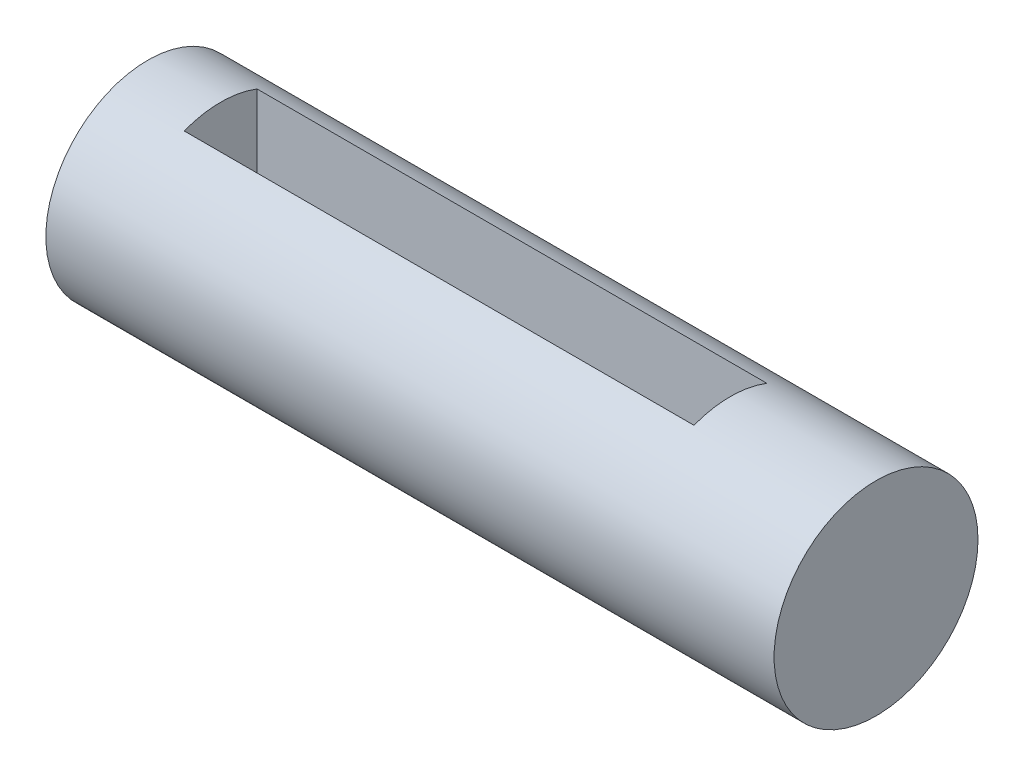
ISO-10303-21;
HEADER;
FILE_DESCRIPTION(('STEP AP214'),'2;1');
FILE_NAME('part.step','',(''),(''),'','','');
FILE_SCHEMA(('AUTOMOTIVE_DESIGN { 1 0 10303 214 1 1 1 1 }'));
ENDSEC;
DATA;
#1=APPLICATION_CONTEXT('core data for automotive mechanical design processes');
#2=APPLICATION_PROTOCOL_DEFINITION('international standard','automotive_design',2000,#1);
#3=PRODUCT_CONTEXT('',#1,'mechanical');
#4=PRODUCT('Part','Part','',(#3));
#5=PRODUCT_RELATED_PRODUCT_CATEGORY('part','',(#4));
#6=PRODUCT_DEFINITION_FORMATION('','',#4);
#7=PRODUCT_DEFINITION_CONTEXT('part definition',#1,'design');
#8=PRODUCT_DEFINITION('design','',#6,#7);
#9=PRODUCT_DEFINITION_SHAPE('','',#8);
#10=(LENGTH_UNIT() NAMED_UNIT(*) SI_UNIT(.MILLI.,.METRE.));
#11=(NAMED_UNIT(*) PLANE_ANGLE_UNIT() SI_UNIT($,.RADIAN.));
#12=(NAMED_UNIT(*) SI_UNIT($,.STERADIAN.) SOLID_ANGLE_UNIT());
#13=UNCERTAINTY_MEASURE_WITH_UNIT(LENGTH_MEASURE(1.E-05),#10,'distance_accuracy_value','');
#14=(GEOMETRIC_REPRESENTATION_CONTEXT(3) GLOBAL_UNCERTAINTY_ASSIGNED_CONTEXT((#13)) GLOBAL_UNIT_ASSIGNED_CONTEXT((#10,
#11,#12)) REPRESENTATION_CONTEXT('',''));
#15=CARTESIAN_POINT('',(0.,0.,0.));
#16=DIRECTION('',(0.,0.,1.));
#17=DIRECTION('',(1.,0.,0.));
#18=AXIS2_PLACEMENT_3D('',#15,#16,#17);
#19=CARTESIAN_POINT('',(50.,0.,0.));
#20=DIRECTION('',(-1.,0.,0.));
#21=DIRECTION('',(0.,0.,1.));
#22=AXIS2_PLACEMENT_3D('',#19,#20,#21);
#23=CYLINDRICAL_SURFACE('',#22,7.);
#24=DIRECTION('',(-1.,0.,0.));
#25=VECTOR('',#24,1.);
#26=CARTESIAN_POINT('',(50.,-6.53834841531101,-2.5));
#27=LINE('',#26,#25);
#28=CARTESIAN_POINT('',(5.,-6.53834841531101,-2.5));
#29=VERTEX_POINT('',#28);
#30=CARTESIAN_POINT('',(40.,-6.53834841531101,-2.5));
#31=VERTEX_POINT('',#30);
#32=EDGE_CURVE('E93',#29,#31,#27,.F.);
#33=ORIENTED_EDGE('',*,*,#32,.F.);
#34=CARTESIAN_POINT('',(5.,0.,0.));
#35=DIRECTION('',(-1.,0.,0.));
#36=DIRECTION('',(0.,-1.,0.));
#37=AXIS2_PLACEMENT_3D('',#34,#35,#36);
#38=CIRCLE('',#37,7.);
#39=CARTESIAN_POINT('',(5.,-6.53834841531101,2.5));
#40=VERTEX_POINT('',#39);
#41=EDGE_CURVE('E86',#29,#40,#38,.T.);
#42=ORIENTED_EDGE('',*,*,#41,.T.);
#43=DIRECTION('',(-1.,0.,0.));
#44=VECTOR('',#43,1.);
#45=CARTESIAN_POINT('',(50.,-6.53834841531101,2.5));
#46=LINE('',#45,#44);
#47=CARTESIAN_POINT('',(40.,-6.53834841531101,2.5));
#48=VERTEX_POINT('',#47);
#49=EDGE_CURVE('E76',#40,#48,#46,.F.);
#50=ORIENTED_EDGE('',*,*,#49,.T.);
#51=CARTESIAN_POINT('',(40.,0.,0.));
#52=DIRECTION('',(1.,0.,0.));
#53=DIRECTION('',(0.,0.,-1.));
#54=AXIS2_PLACEMENT_3D('',#51,#52,#53);
#55=CIRCLE('',#54,7.);
#56=EDGE_CURVE('E80',#48,#31,#55,.T.);
#57=ORIENTED_EDGE('',*,*,#56,.T.);
#58=EDGE_LOOP('',(#33,#42,#50,#57));
#59=FACE_BOUND('',#58,.T.);
#60=CARTESIAN_POINT('',(50.,0.,0.));
#61=DIRECTION('',(1.,0.,0.));
#62=DIRECTION('',(0.,0.,-1.));
#63=AXIS2_PLACEMENT_3D('',#60,#61,#62);
#64=CIRCLE('',#63,7.);
#65=CARTESIAN_POINT('',(50.,0.,-7.));
#66=VERTEX_POINT('',#65);
#67=EDGE_CURVE('E81',#66,#66,#64,.T.);
#68=ORIENTED_EDGE('',*,*,#67,.F.);
#69=EDGE_LOOP('',(#68));
#70=FACE_BOUND('',#69,.T.);
#71=CARTESIAN_POINT('',(0.,0.,0.));
#72=DIRECTION('',(1.,0.,0.));
#73=DIRECTION('',(0.,0.,-1.));
#74=AXIS2_PLACEMENT_3D('',#71,#72,#73);
#75=CIRCLE('',#74,7.);
#76=CARTESIAN_POINT('',(0.,0.,-7.));
#77=VERTEX_POINT('',#76);
#78=EDGE_CURVE('E103',#77,#77,#75,.T.);
#79=ORIENTED_EDGE('',*,*,#78,.T.);
#80=EDGE_LOOP('',(#79));
#81=FACE_BOUND('',#80,.T.);
#82=CARTESIAN_POINT('',(5.,6.53834841531101,2.5));
#83=VERTEX_POINT('',#82);
#84=CARTESIAN_POINT('',(5.,6.53834841531101,-2.5));
#85=VERTEX_POINT('',#84);
#86=EDGE_CURVE('E46',#83,#85,#38,.T.);
#87=ORIENTED_EDGE('',*,*,#86,.T.);
#88=DIRECTION('',(-1.,0.,0.));
#89=VECTOR('',#88,1.);
#90=CARTESIAN_POINT('',(50.,6.53834841531101,-2.5));
#91=LINE('',#90,#89);
#92=CARTESIAN_POINT('',(40.,6.53834841531101,-2.5));
#93=VERTEX_POINT('',#92);
#94=EDGE_CURVE('E11',#93,#85,#91,.T.);
#95=ORIENTED_EDGE('',*,*,#94,.F.);
#96=CARTESIAN_POINT('',(40.,6.53834841531101,2.5));
#97=VERTEX_POINT('',#96);
#98=EDGE_CURVE('E98',#93,#97,#55,.T.);
#99=ORIENTED_EDGE('',*,*,#98,.T.);
#100=DIRECTION('',(-1.,0.,0.));
#101=VECTOR('',#100,1.);
#102=CARTESIAN_POINT('',(50.,6.53834841531101,2.5));
#103=LINE('',#102,#101);
#104=EDGE_CURVE('E95',#97,#83,#103,.T.);
#105=ORIENTED_EDGE('',*,*,#104,.T.);
#106=EDGE_LOOP('',(#87,#95,#99,#105));
#107=FACE_BOUND('',#106,.T.);
#108=ADVANCED_FACE('F39',(#59,#70,#81,#107),#23,.T.);
#109=CARTESIAN_POINT('',(50.,0.,0.));
#110=DIRECTION('',(1.,0.,0.));
#111=DIRECTION('',(0.,0.,-1.));
#112=AXIS2_PLACEMENT_3D('',#109,#110,#111);
#113=PLANE('',#112);
#114=ORIENTED_EDGE('',*,*,#67,.T.);
#115=EDGE_LOOP('',(#114));
#116=FACE_BOUND('',#115,.T.);
#117=ADVANCED_FACE('F117',(#116),#113,.T.);
#118=CARTESIAN_POINT('',(0.,0.,0.));
#119=DIRECTION('',(1.,0.,0.));
#120=DIRECTION('',(0.,0.,-1.));
#121=AXIS2_PLACEMENT_3D('',#118,#119,#120);
#122=PLANE('',#121);
#123=ORIENTED_EDGE('',*,*,#78,.F.);
#124=EDGE_LOOP('',(#123));
#125=FACE_BOUND('',#124,.T.);
#126=ADVANCED_FACE('F123',(#125),#122,.F.);
#127=CARTESIAN_POINT('',(5.,7.,-2.5));
#128=DIRECTION('',(-1.,0.,0.));
#129=DIRECTION('',(0.,-1.,0.));
#130=AXIS2_PLACEMENT_3D('',#127,#128,#129);
#131=PLANE('',#130);
#132=DIRECTION('',(0.,-1.,0.));
#133=VECTOR('',#132,1.);
#134=CARTESIAN_POINT('',(5.,7.,2.5));
#135=LINE('',#134,#133);
#136=EDGE_CURVE('E53',#83,#40,#135,.T.);
#137=ORIENTED_EDGE('',*,*,#136,.T.);
#138=ORIENTED_EDGE('',*,*,#41,.F.);
#139=DIRECTION('',(0.,-1.,0.));
#140=VECTOR('',#139,1.);
#141=CARTESIAN_POINT('',(5.,7.,-2.5));
#142=LINE('',#141,#140);
#143=EDGE_CURVE('E109',#85,#29,#142,.T.);
#144=ORIENTED_EDGE('',*,*,#143,.F.);
#145=ORIENTED_EDGE('',*,*,#86,.F.);
#146=EDGE_LOOP('',(#137,#138,#144,#145));
#147=FACE_BOUND('',#146,.T.);
#148=ADVANCED_FACE('F84',(#147),#131,.F.);
#149=CARTESIAN_POINT('',(40.,7.,-2.5));
#150=DIRECTION('',(1.,0.,0.));
#151=DIRECTION('',(0.,0.,-1.));
#152=AXIS2_PLACEMENT_3D('',#149,#150,#151);
#153=PLANE('',#152);
#154=DIRECTION('',(0.,1.,0.));
#155=VECTOR('',#154,1.);
#156=CARTESIAN_POINT('',(40.,7.,-2.5));
#157=LINE('',#156,#155);
#158=EDGE_CURVE('E106',#31,#93,#157,.T.);
#159=ORIENTED_EDGE('',*,*,#158,.F.);
#160=ORIENTED_EDGE('',*,*,#56,.F.);
#161=DIRECTION('',(0.,1.,0.));
#162=VECTOR('',#161,1.);
#163=CARTESIAN_POINT('',(40.,7.,2.5));
#164=LINE('',#163,#162);
#165=EDGE_CURVE('E58',#48,#97,#164,.T.);
#166=ORIENTED_EDGE('',*,*,#165,.T.);
#167=ORIENTED_EDGE('',*,*,#98,.F.);
#168=EDGE_LOOP('',(#159,#160,#166,#167));
#169=FACE_BOUND('',#168,.T.);
#170=ADVANCED_FACE('F131',(#169),#153,.F.);
#171=CARTESIAN_POINT('',(0.,0.,-2.5));
#172=DIRECTION('',(0.,0.,1.));
#173=DIRECTION('',(1.,0.,0.));
#174=AXIS2_PLACEMENT_3D('',#171,#172,#173);
#175=PLANE('',#174);
#176=ORIENTED_EDGE('',*,*,#94,.T.);
#177=ORIENTED_EDGE('',*,*,#143,.T.);
#178=ORIENTED_EDGE('',*,*,#32,.T.);
#179=ORIENTED_EDGE('',*,*,#158,.T.);
#180=EDGE_LOOP('',(#176,#177,#178,#179));
#181=FACE_BOUND('',#180,.T.);
#182=ADVANCED_FACE('F114',(#181),#175,.T.);
#183=CARTESIAN_POINT('',(0.,0.,2.5));
#184=DIRECTION('',(0.,0.,1.));
#185=DIRECTION('',(1.,0.,0.));
#186=AXIS2_PLACEMENT_3D('',#183,#184,#185);
#187=PLANE('',#186);
#188=ORIENTED_EDGE('',*,*,#165,.F.);
#189=ORIENTED_EDGE('',*,*,#49,.F.);
#190=ORIENTED_EDGE('',*,*,#136,.F.);
#191=ORIENTED_EDGE('',*,*,#104,.F.);
#192=EDGE_LOOP('',(#188,#189,#190,#191));
#193=FACE_BOUND('',#192,.T.);
#194=ADVANCED_FACE('F77',(#193),#187,.F.);
#195=CLOSED_SHELL('',(#108,#117,#126,#148,#170,#182,#194));
#196=MANIFOLD_SOLID_BREP('B2',#195);
#197=ADVANCED_BREP_SHAPE_REPRESENTATION('',(#18,#196),#14);
#198=SHAPE_DEFINITION_REPRESENTATION(#9,#197);
ENDSEC;
END-ISO-10303-21;
